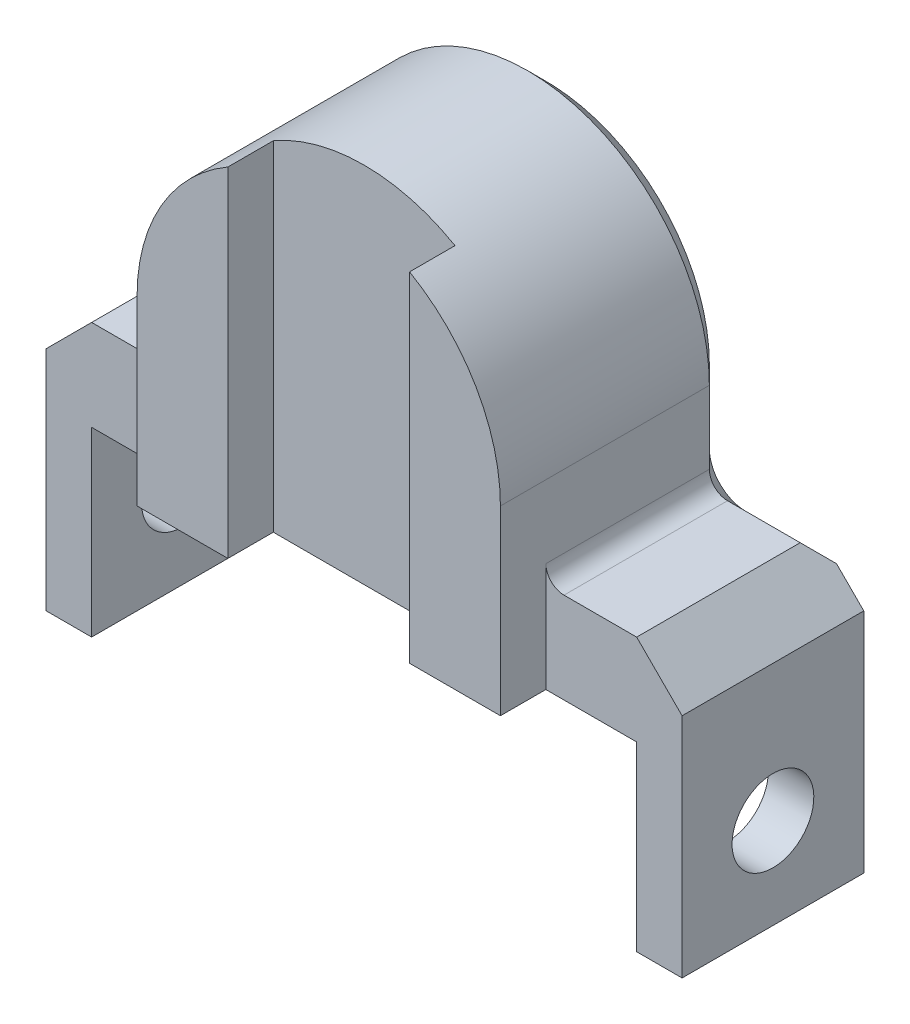
ISO-10303-21;
HEADER;
FILE_DESCRIPTION(('STEP AP214'),'2;1');
FILE_NAME('part.step','',(''),(''),'','','');
FILE_SCHEMA(('AUTOMOTIVE_DESIGN { 1 0 10303 214 1 1 1 1 }'));
ENDSEC;
DATA;
#1=APPLICATION_CONTEXT('core data for automotive mechanical design processes');
#2=APPLICATION_PROTOCOL_DEFINITION('international standard','automotive_design',2000,#1);
#3=PRODUCT_CONTEXT('',#1,'mechanical');
#4=PRODUCT('Part','Part','',(#3));
#5=PRODUCT_RELATED_PRODUCT_CATEGORY('part','',(#4));
#6=PRODUCT_DEFINITION_FORMATION('','',#4);
#7=PRODUCT_DEFINITION_CONTEXT('part definition',#1,'design');
#8=PRODUCT_DEFINITION('design','',#6,#7);
#9=PRODUCT_DEFINITION_SHAPE('','',#8);
#10=(LENGTH_UNIT() NAMED_UNIT(*) SI_UNIT(.MILLI.,.METRE.));
#11=(NAMED_UNIT(*) PLANE_ANGLE_UNIT() SI_UNIT($,.RADIAN.));
#12=(NAMED_UNIT(*) SI_UNIT($,.STERADIAN.) SOLID_ANGLE_UNIT());
#13=UNCERTAINTY_MEASURE_WITH_UNIT(LENGTH_MEASURE(1.E-05),#10,'distance_accuracy_value','');
#14=(GEOMETRIC_REPRESENTATION_CONTEXT(3) GLOBAL_UNCERTAINTY_ASSIGNED_CONTEXT((#13)) GLOBAL_UNIT_ASSIGNED_CONTEXT((#10,
#11,#12)) REPRESENTATION_CONTEXT('',''));
#15=CARTESIAN_POINT('',(0.,0.,0.));
#16=DIRECTION('',(0.,0.,1.));
#17=DIRECTION('',(1.,0.,0.));
#18=AXIS2_PLACEMENT_3D('',#15,#16,#17);
#19=CARTESIAN_POINT('',(0.,20.,10.));
#20=DIRECTION('',(0.,0.,1.));
#21=DIRECTION('',(1.,0.,0.));
#22=AXIS2_PLACEMENT_3D('',#19,#20,#21);
#23=PLANE('',#22);
#24=DIRECTION('',(1.,0.,0.));
#25=VECTOR('',#24,1.);
#26=CARTESIAN_POINT('',(-29.9999999999999,-2.08166817117217E-13,10.));
#27=LINE('',#26,#25);
#28=CARTESIAN_POINT('',(-29.9999999999999,-2.08166817117217E-13,10.));
#29=VERTEX_POINT('',#28);
#30=CARTESIAN_POINT('',(-20.,-1.73472347597681E-13,10.));
#31=VERTEX_POINT('',#30);
#32=EDGE_CURVE('E306',#29,#31,#27,.T.);
#33=ORIENTED_EDGE('',*,*,#32,.T.);
#34=DIRECTION('',(0.,-1.,0.));
#35=VECTOR('',#34,1.);
#36=CARTESIAN_POINT('',(-20.,19.9999999999999,10.));
#37=LINE('',#36,#35);
#38=CARTESIAN_POINT('',(-20.,11.9999999999998,10.));
#39=VERTEX_POINT('',#38);
#40=EDGE_CURVE('E244',#39,#31,#37,.T.);
#41=ORIENTED_EDGE('',*,*,#40,.F.);
#42=CARTESIAN_POINT('',(-21.9999999999999,11.9999999999998,10.));
#43=DIRECTION('',(0.,0.,1.));
#44=DIRECTION('',(1.,0.,0.));
#45=AXIS2_PLACEMENT_3D('',#42,#43,#44);
#46=CIRCLE('',#45,2.);
#47=CARTESIAN_POINT('',(-21.9999999999999,9.99999999999985,10.));
#48=VERTEX_POINT('',#47);
#49=EDGE_CURVE('E378',#39,#48,#46,.F.);
#50=ORIENTED_EDGE('',*,*,#49,.T.);
#51=DIRECTION('',(-1.,0.,0.));
#52=VECTOR('',#51,1.);
#53=CARTESIAN_POINT('',(-19.9999999999999,9.99999999999986,10.));
#54=LINE('',#53,#52);
#55=CARTESIAN_POINT('',(-29.9999999999999,9.99999999999979,10.));
#56=VERTEX_POINT('',#55);
#57=EDGE_CURVE('E296',#48,#56,#54,.T.);
#58=ORIENTED_EDGE('',*,*,#57,.T.);
#59=DIRECTION('',(0.707106781186544,0.707106781186551,0.));
#60=VECTOR('',#59,1.);
#61=CARTESIAN_POINT('',(-10.,29.9999999999999,10.));
#62=LINE('',#61,#60);
#63=CARTESIAN_POINT('',(-34.9999999999999,4.99999999999978,10.));
#64=VERTEX_POINT('',#63);
#65=EDGE_CURVE('E360',#56,#64,#62,.F.);
#66=ORIENTED_EDGE('',*,*,#65,.T.);
#67=DIRECTION('',(0.,-1.,0.));
#68=VECTOR('',#67,1.);
#69=CARTESIAN_POINT('',(-34.9999999999997,-20.0000000000002,10.));
#70=LINE('',#69,#68);
#71=CARTESIAN_POINT('',(-34.9999999999997,-20.0000000000002,10.));
#72=VERTEX_POINT('',#71);
#73=EDGE_CURVE('E299',#64,#72,#70,.T.);
#74=ORIENTED_EDGE('',*,*,#73,.T.);
#75=DIRECTION('',(1.,0.,0.));
#76=VECTOR('',#75,1.);
#77=CARTESIAN_POINT('',(-29.9999999999997,-20.0000000000002,10.));
#78=LINE('',#77,#76);
#79=CARTESIAN_POINT('',(-29.9999999999997,-20.0000000000002,10.));
#80=VERTEX_POINT('',#79);
#81=EDGE_CURVE('E301',#72,#80,#78,.T.);
#82=ORIENTED_EDGE('',*,*,#81,.T.);
#83=DIRECTION('',(0.,1.,0.));
#84=VECTOR('',#83,1.);
#85=CARTESIAN_POINT('',(-29.9999999999999,-2.08166817117217E-13,10.));
#86=LINE('',#85,#84);
#87=EDGE_CURVE('E303',#80,#29,#86,.T.);
#88=ORIENTED_EDGE('',*,*,#87,.T.);
#89=EDGE_LOOP('',(#33,#41,#50,#58,#66,#74,#82,#88));
#90=FACE_BOUND('',#89,.T.);
#91=ADVANCED_FACE('F40',(#90),#23,.T.);
#92=CARTESIAN_POINT('',(0.,20.,10.));
#93=DIRECTION('',(0.,0.,1.));
#94=DIRECTION('',(1.,0.,0.));
#95=AXIS2_PLACEMENT_3D('',#92,#93,#94);
#96=CIRCLE('',#95,20.);
#97=CARTESIAN_POINT('',(10.,37.3205080756888,10.));
#98=VERTEX_POINT('',#97);
#99=CARTESIAN_POINT('',(-10.,37.3205080756888,10.));
#100=VERTEX_POINT('',#99);
#101=EDGE_CURVE('E293',#98,#100,#96,.T.);
#102=ORIENTED_EDGE('',*,*,#101,.T.);
#103=DIRECTION('',(0.,1.,0.));
#104=VECTOR('',#103,1.);
#105=CARTESIAN_POINT('',(-10.,-1.38777878078145E-13,10.));
#106=LINE('',#105,#104);
#107=CARTESIAN_POINT('',(-10.,-1.38777878078145E-13,10.));
#108=VERTEX_POINT('',#107);
#109=EDGE_CURVE('E242',#108,#100,#106,.T.);
#110=ORIENTED_EDGE('',*,*,#109,.F.);
#111=CARTESIAN_POINT('',(10.,-1.38777878078145E-13,10.));
#112=VERTEX_POINT('',#111);
#113=EDGE_CURVE('E310',#108,#112,#27,.T.);
#114=ORIENTED_EDGE('',*,*,#113,.T.);
#115=DIRECTION('',(0.,-1.,0.));
#116=VECTOR('',#115,1.);
#117=CARTESIAN_POINT('',(10.,-1.38777878078145E-13,10.));
#118=LINE('',#117,#116);
#119=EDGE_CURVE('E66',#98,#112,#118,.T.);
#120=ORIENTED_EDGE('',*,*,#119,.F.);
#121=EDGE_LOOP('',(#102,#110,#114,#120));
#122=FACE_BOUND('',#121,.T.);
#123=ADVANCED_FACE('F468',(#122),#23,.T.);
#124=DIRECTION('',(0.,1.,0.));
#125=VECTOR('',#124,1.);
#126=CARTESIAN_POINT('',(20.,19.9999999999999,10.));
#127=LINE('',#126,#125);
#128=CARTESIAN_POINT('',(20.,0.,10.));
#129=VERTEX_POINT('',#128);
#130=CARTESIAN_POINT('',(20.,12.,10.));
#131=VERTEX_POINT('',#130);
#132=EDGE_CURVE('E254',#129,#131,#127,.T.);
#133=ORIENTED_EDGE('',*,*,#132,.F.);
#134=CARTESIAN_POINT('',(30.,0.,10.));
#135=VERTEX_POINT('',#134);
#136=EDGE_CURVE('E305',#129,#135,#27,.T.);
#137=ORIENTED_EDGE('',*,*,#136,.T.);
#138=DIRECTION('',(0.,-1.,0.));
#139=VECTOR('',#138,1.);
#140=CARTESIAN_POINT('',(30.,0.,10.));
#141=LINE('',#140,#139);
#142=CARTESIAN_POINT('',(30.,-20.,10.));
#143=VERTEX_POINT('',#142);
#144=EDGE_CURVE('E309',#135,#143,#141,.T.);
#145=ORIENTED_EDGE('',*,*,#144,.T.);
#146=DIRECTION('',(1.,0.,0.));
#147=VECTOR('',#146,1.);
#148=CARTESIAN_POINT('',(30.,-20.,10.));
#149=LINE('',#148,#147);
#150=CARTESIAN_POINT('',(35.,-20.,10.));
#151=VERTEX_POINT('',#150);
#152=EDGE_CURVE('E312',#143,#151,#149,.T.);
#153=ORIENTED_EDGE('',*,*,#152,.T.);
#154=DIRECTION('',(0.,1.,0.));
#155=VECTOR('',#154,1.);
#156=CARTESIAN_POINT('',(35.,-20.,10.));
#157=LINE('',#156,#155);
#158=CARTESIAN_POINT('',(35.,4.99999999999998,10.));
#159=VERTEX_POINT('',#158);
#160=EDGE_CURVE('E314',#151,#159,#157,.T.);
#161=ORIENTED_EDGE('',*,*,#160,.T.);
#162=DIRECTION('',(0.707106781186546,-0.70710678118655,0.));
#163=VECTOR('',#162,1.);
#164=CARTESIAN_POINT('',(10.0000000000001,30.,10.));
#165=LINE('',#164,#163);
#166=CARTESIAN_POINT('',(30.,10.,10.));
#167=VERTEX_POINT('',#166);
#168=EDGE_CURVE('E358',#159,#167,#165,.F.);
#169=ORIENTED_EDGE('',*,*,#168,.T.);
#170=DIRECTION('',(-1.,0.,0.));
#171=VECTOR('',#170,1.);
#172=CARTESIAN_POINT('',(20.,10.,10.));
#173=LINE('',#172,#171);
#174=CARTESIAN_POINT('',(22.,10.,10.));
#175=VERTEX_POINT('',#174);
#176=EDGE_CURVE('E290',#167,#175,#173,.T.);
#177=ORIENTED_EDGE('',*,*,#176,.T.);
#178=CARTESIAN_POINT('',(22.,12.,10.));
#179=DIRECTION('',(0.,0.,1.));
#180=DIRECTION('',(1.,0.,0.));
#181=AXIS2_PLACEMENT_3D('',#178,#179,#180);
#182=CIRCLE('',#181,2.);
#183=EDGE_CURVE('E380',#175,#131,#182,.F.);
#184=ORIENTED_EDGE('',*,*,#183,.T.);
#185=EDGE_LOOP('',(#133,#137,#145,#153,#161,#169,#177,#184));
#186=FACE_BOUND('',#185,.T.);
#187=ADVANCED_FACE('F514',(#186),#23,.T.);
#188=CARTESIAN_POINT('',(20.,10.,10.));
#189=DIRECTION('',(0.,-1.,0.));
#190=DIRECTION('',(1.,0.,0.));
#191=AXIS2_PLACEMENT_3D('',#188,#189,#190);
#192=PLANE('',#191);
#193=DIRECTION('',(0.,0.,-1.));
#194=VECTOR('',#193,1.);
#195=CARTESIAN_POINT('',(30.,10.,10.));
#196=LINE('',#195,#194);
#197=CARTESIAN_POINT('',(30.,10.,-8.00000000000001));
#198=VERTEX_POINT('',#197);
#199=EDGE_CURVE('E362',#167,#198,#196,.T.);
#200=ORIENTED_EDGE('',*,*,#199,.T.);
#201=DIRECTION('',(-1.,0.,0.));
#202=VECTOR('',#201,1.);
#203=CARTESIAN_POINT('',(20.,10.,-8.00000000000001));
#204=LINE('',#203,#202);
#205=CARTESIAN_POINT('',(22.,10.,-8.00000000000001));
#206=VERTEX_POINT('',#205);
#207=EDGE_CURVE('E382',#198,#206,#204,.T.);
#208=ORIENTED_EDGE('',*,*,#207,.T.);
#209=DIRECTION('',(0.,0.,-1.));
#210=VECTOR('',#209,1.);
#211=CARTESIAN_POINT('',(22.,10.,10.));
#212=LINE('',#211,#210);
#213=EDGE_CURVE('E376',#206,#175,#212,.F.);
#214=ORIENTED_EDGE('',*,*,#213,.T.);
#215=ORIENTED_EDGE('',*,*,#176,.F.);
#216=EDGE_LOOP('',(#200,#208,#214,#215));
#217=FACE_BOUND('',#216,.T.);
#218=ADVANCED_FACE('F521',(#217),#192,.F.);
#219=CARTESIAN_POINT('',(20.,20.,10.));
#220=DIRECTION('',(-1.,0.,0.));
#221=DIRECTION('',(0.,0.,1.));
#222=AXIS2_PLACEMENT_3D('',#219,#220,#221);
#223=PLANE('',#222);
#224=DIRECTION('',(0.,0.,-1.));
#225=VECTOR('',#224,1.);
#226=CARTESIAN_POINT('',(20.,12.,-10.));
#227=LINE('',#226,#225);
#228=CARTESIAN_POINT('',(20.,12.,-8.00000000000001));
#229=VERTEX_POINT('',#228);
#230=EDGE_CURVE('E373',#131,#229,#227,.T.);
#231=ORIENTED_EDGE('',*,*,#230,.T.);
#232=DIRECTION('',(0.,1.,0.));
#233=VECTOR('',#232,1.);
#234=CARTESIAN_POINT('',(20.,20.,-8.00000000000001));
#235=LINE('',#234,#233);
#236=CARTESIAN_POINT('',(20.,20.,-8.00000000000001));
#237=VERTEX_POINT('',#236);
#238=EDGE_CURVE('E409',#229,#237,#235,.T.);
#239=ORIENTED_EDGE('',*,*,#238,.T.);
#240=DIRECTION('',(0.,0.,-1.));
#241=VECTOR('',#240,1.);
#242=CARTESIAN_POINT('',(20.,20.,10.));
#243=LINE('',#242,#241);
#244=CARTESIAN_POINT('',(20.,19.9999999999999,15.));
#245=VERTEX_POINT('',#244);
#246=EDGE_CURVE('E227',#245,#237,#243,.T.);
#247=ORIENTED_EDGE('',*,*,#246,.F.);
#248=DIRECTION('',(0.,1.,0.));
#249=VECTOR('',#248,1.);
#250=CARTESIAN_POINT('',(20.,19.9999999999999,15.));
#251=LINE('',#250,#249);
#252=CARTESIAN_POINT('',(20.,-1.73472347597681E-13,15.));
#253=VERTEX_POINT('',#252);
#254=EDGE_CURVE('E255',#253,#245,#251,.T.);
#255=ORIENTED_EDGE('',*,*,#254,.F.);
#256=DIRECTION('',(0.,0.,-1.));
#257=VECTOR('',#256,1.);
#258=CARTESIAN_POINT('',(20.,-1.73472347597681E-13,15.));
#259=LINE('',#258,#257);
#260=EDGE_CURVE('E264',#253,#129,#259,.T.);
#261=ORIENTED_EDGE('',*,*,#260,.T.);
#262=ORIENTED_EDGE('',*,*,#132,.T.);
#263=EDGE_LOOP('',(#231,#239,#247,#255,#261,#262));
#264=FACE_BOUND('',#263,.T.);
#265=ADVANCED_FACE('F526',(#264),#223,.F.);
#266=CARTESIAN_POINT('',(0.,20.,10.));
#267=DIRECTION('',(0.,0.,-1.));
#268=DIRECTION('',(-1.,0.,0.));
#269=AXIS2_PLACEMENT_3D('',#266,#267,#268);
#270=CYLINDRICAL_SURFACE('',#269,20.);
#271=ORIENTED_EDGE('',*,*,#246,.T.);
#272=CARTESIAN_POINT('',(0.,20.,-8.00000000000001));
#273=DIRECTION('',(0.,0.,1.));
#274=DIRECTION('',(1.,0.,0.));
#275=AXIS2_PLACEMENT_3D('',#272,#273,#274);
#276=CIRCLE('',#275,20.);
#277=CARTESIAN_POINT('',(-20.,19.9999999999999,-8.00000000000001));
#278=VERTEX_POINT('',#277);
#279=EDGE_CURVE('E11',#237,#278,#276,.T.);
#280=ORIENTED_EDGE('',*,*,#279,.T.);
#281=DIRECTION('',(0.,0.,-1.));
#282=VECTOR('',#281,1.);
#283=CARTESIAN_POINT('',(-20.,19.9999999999999,10.));
#284=LINE('',#283,#282);
#285=CARTESIAN_POINT('',(-20.,19.9999999999999,15.));
#286=VERTEX_POINT('',#285);
#287=EDGE_CURVE('E217',#286,#278,#284,.T.);
#288=ORIENTED_EDGE('',*,*,#287,.F.);
#289=CARTESIAN_POINT('',(0.,20.,15.));
#290=DIRECTION('',(0.,0.,1.));
#291=DIRECTION('',(1.,0.,0.));
#292=AXIS2_PLACEMENT_3D('',#289,#290,#291);
#293=CIRCLE('',#292,20.);
#294=CARTESIAN_POINT('',(-10.,37.3205080756888,15.));
#295=VERTEX_POINT('',#294);
#296=EDGE_CURVE('E223',#295,#286,#293,.T.);
#297=ORIENTED_EDGE('',*,*,#296,.F.);
#298=DIRECTION('',(0.,0.,-1.));
#299=VECTOR('',#298,1.);
#300=CARTESIAN_POINT('',(-10.,37.3205080756888,15.));
#301=LINE('',#300,#299);
#302=EDGE_CURVE('E249',#295,#100,#301,.T.);
#303=ORIENTED_EDGE('',*,*,#302,.T.);
#304=ORIENTED_EDGE('',*,*,#101,.F.);
#305=DIRECTION('',(0.,0.,-1.));
#306=VECTOR('',#305,1.);
#307=CARTESIAN_POINT('',(10.,37.3205080756888,15.));
#308=LINE('',#307,#306);
#309=CARTESIAN_POINT('',(10.,37.3205080756888,15.));
#310=VERTEX_POINT('',#309);
#311=EDGE_CURVE('E273',#310,#98,#308,.T.);
#312=ORIENTED_EDGE('',*,*,#311,.F.);
#313=CARTESIAN_POINT('',(0.,20.,15.));
#314=DIRECTION('',(0.,0.,1.));
#315=DIRECTION('',(-1.,0.,0.));
#316=AXIS2_PLACEMENT_3D('',#313,#314,#315);
#317=CIRCLE('',#316,20.);
#318=EDGE_CURVE('E258',#245,#310,#317,.T.);
#319=ORIENTED_EDGE('',*,*,#318,.F.);
#320=EDGE_LOOP('',(#271,#280,#288,#297,#303,#304,#312,#319));
#321=FACE_BOUND('',#320,.T.);
#322=ADVANCED_FACE('F220',(#321),#270,.T.);
#323=CARTESIAN_POINT('',(-20.,19.9999999999999,10.));
#324=DIRECTION('',(1.,0.,0.));
#325=DIRECTION('',(0.,1.,0.));
#326=AXIS2_PLACEMENT_3D('',#323,#324,#325);
#327=PLANE('',#326);
#328=ORIENTED_EDGE('',*,*,#287,.T.);
#329=DIRECTION('',(0.,-1.,0.));
#330=VECTOR('',#329,1.);
#331=CARTESIAN_POINT('',(-20.,19.9999999999999,-8.00000000000001));
#332=LINE('',#331,#330);
#333=CARTESIAN_POINT('',(-19.9999999999999,11.9999999999999,-8.00000000000001));
#334=VERTEX_POINT('',#333);
#335=EDGE_CURVE('E50',#278,#334,#332,.T.);
#336=ORIENTED_EDGE('',*,*,#335,.T.);
#337=DIRECTION('',(0.,0.,-1.));
#338=VECTOR('',#337,1.);
#339=CARTESIAN_POINT('',(-19.9999999999999,11.9999999999999,10.));
#340=LINE('',#339,#338);
#341=EDGE_CURVE('E370',#334,#39,#340,.F.);
#342=ORIENTED_EDGE('',*,*,#341,.T.);
#343=ORIENTED_EDGE('',*,*,#40,.T.);
#344=DIRECTION('',(0.,0.,-1.));
#345=VECTOR('',#344,1.);
#346=CARTESIAN_POINT('',(-20.,-1.73472347597681E-13,15.));
#347=LINE('',#346,#345);
#348=CARTESIAN_POINT('',(-20.,-1.73472347597681E-13,15.));
#349=VERTEX_POINT('',#348);
#350=EDGE_CURVE('E234',#349,#31,#347,.T.);
#351=ORIENTED_EDGE('',*,*,#350,.F.);
#352=DIRECTION('',(0.,-1.,0.));
#353=VECTOR('',#352,1.);
#354=CARTESIAN_POINT('',(-20.,19.9999999999999,15.));
#355=LINE('',#354,#353);
#356=EDGE_CURVE('E231',#286,#349,#355,.T.);
#357=ORIENTED_EDGE('',*,*,#356,.F.);
#358=EDGE_LOOP('',(#328,#336,#342,#343,#351,#357));
#359=FACE_BOUND('',#358,.T.);
#360=ADVANCED_FACE('F232',(#359),#327,.F.);
#361=CARTESIAN_POINT('',(-19.9999999999999,9.99999999999986,10.));
#362=DIRECTION('',(0.,-1.,0.));
#363=DIRECTION('',(1.,0.,0.));
#364=AXIS2_PLACEMENT_3D('',#361,#362,#363);
#365=PLANE('',#364);
#366=DIRECTION('',(0.,0.,-1.));
#367=VECTOR('',#366,1.);
#368=CARTESIAN_POINT('',(-21.9999999999999,9.99999999999985,-10.));
#369=LINE('',#368,#367);
#370=CARTESIAN_POINT('',(-21.9999999999999,9.99999999999985,-8.00000000000001));
#371=VERTEX_POINT('',#370);
#372=EDGE_CURVE('E367',#48,#371,#369,.T.);
#373=ORIENTED_EDGE('',*,*,#372,.T.);
#374=DIRECTION('',(-1.,0.,0.));
#375=VECTOR('',#374,1.);
#376=CARTESIAN_POINT('',(-19.9999999999999,9.99999999999986,-8.00000000000001));
#377=LINE('',#376,#375);
#378=CARTESIAN_POINT('',(-29.9999999999999,9.99999999999979,-8.00000000000001));
#379=VERTEX_POINT('',#378);
#380=EDGE_CURVE('E401',#371,#379,#377,.T.);
#381=ORIENTED_EDGE('',*,*,#380,.T.);
#382=DIRECTION('',(0.,0.,1.));
#383=VECTOR('',#382,1.);
#384=CARTESIAN_POINT('',(-29.9999999999999,9.99999999999979,10.));
#385=LINE('',#384,#383);
#386=EDGE_CURVE('E356',#379,#56,#385,.T.);
#387=ORIENTED_EDGE('',*,*,#386,.T.);
#388=ORIENTED_EDGE('',*,*,#57,.F.);
#389=EDGE_LOOP('',(#373,#381,#387,#388));
#390=FACE_BOUND('',#389,.T.);
#391=ADVANCED_FACE('F438',(#390),#365,.F.);
#392=CARTESIAN_POINT('',(-34.9999999999997,-20.0000000000002,10.));
#393=DIRECTION('',(1.,0.,0.));
#394=DIRECTION('',(0.,1.,0.));
#395=AXIS2_PLACEMENT_3D('',#392,#393,#394);
#396=PLANE('',#395);
#397=CARTESIAN_POINT('',(-34.9999999999998,-10.0000000000003,0.));
#398=DIRECTION('',(-1.,0.,0.));
#399=DIRECTION('',(0.,-1.,0.));
#400=AXIS2_PLACEMENT_3D('',#397,#398,#399);
#401=CIRCLE('',#400,4.5);
#402=CARTESIAN_POINT('',(-34.9999999999998,-14.5000000000002,0.));
#403=VERTEX_POINT('',#402);
#404=EDGE_CURVE('E281',#403,#403,#401,.T.);
#405=ORIENTED_EDGE('',*,*,#404,.F.);
#406=EDGE_LOOP('',(#405));
#407=FACE_BOUND('',#406,.T.);
#408=ORIENTED_EDGE('',*,*,#73,.F.);
#409=DIRECTION('',(0.,0.,-1.));
#410=VECTOR('',#409,1.);
#411=CARTESIAN_POINT('',(-34.9999999999999,4.99999999999978,10.));
#412=LINE('',#411,#410);
#413=CARTESIAN_POINT('',(-34.9999999999999,4.99999999999978,-10.));
#414=VERTEX_POINT('',#413);
#415=EDGE_CURVE('E348',#64,#414,#412,.T.);
#416=ORIENTED_EDGE('',*,*,#415,.T.);
#417=DIRECTION('',(0.,-1.,0.));
#418=VECTOR('',#417,1.);
#419=CARTESIAN_POINT('',(-34.9999999999997,-20.0000000000002,-10.));
#420=LINE('',#419,#418);
#421=CARTESIAN_POINT('',(-34.9999999999997,-20.0000000000002,-10.));
#422=VERTEX_POINT('',#421);
#423=EDGE_CURVE('E289',#414,#422,#420,.T.);
#424=ORIENTED_EDGE('',*,*,#423,.T.);
#425=DIRECTION('',(0.,0.,-1.));
#426=VECTOR('',#425,1.);
#427=CARTESIAN_POINT('',(-34.9999999999997,-20.0000000000002,10.));
#428=LINE('',#427,#426);
#429=EDGE_CURVE('E228',#72,#422,#428,.T.);
#430=ORIENTED_EDGE('',*,*,#429,.F.);
#431=EDGE_LOOP('',(#408,#416,#424,#430));
#432=FACE_BOUND('',#431,.T.);
#433=ADVANCED_FACE('F449',(#407,#432),#396,.F.);
#434=CARTESIAN_POINT('',(-29.9999999999997,-20.0000000000002,10.));
#435=DIRECTION('',(0.,1.,0.));
#436=DIRECTION('',(-1.,0.,0.));
#437=AXIS2_PLACEMENT_3D('',#434,#435,#436);
#438=PLANE('',#437);
#439=DIRECTION('',(1.,0.,0.));
#440=VECTOR('',#439,1.);
#441=CARTESIAN_POINT('',(-29.9999999999997,-20.0000000000002,-10.));
#442=LINE('',#441,#440);
#443=CARTESIAN_POINT('',(-29.9999999999997,-20.0000000000002,-10.));
#444=VERTEX_POINT('',#443);
#445=EDGE_CURVE('E319',#422,#444,#442,.T.);
#446=ORIENTED_EDGE('',*,*,#445,.T.);
#447=DIRECTION('',(0.,0.,-1.));
#448=VECTOR('',#447,1.);
#449=CARTESIAN_POINT('',(-29.9999999999997,-20.0000000000002,10.));
#450=LINE('',#449,#448);
#451=EDGE_CURVE('E342',#80,#444,#450,.T.);
#452=ORIENTED_EDGE('',*,*,#451,.F.);
#453=ORIENTED_EDGE('',*,*,#81,.F.);
#454=ORIENTED_EDGE('',*,*,#429,.T.);
#455=EDGE_LOOP('',(#446,#452,#453,#454));
#456=FACE_BOUND('',#455,.T.);
#457=ADVANCED_FACE('F455',(#456),#438,.F.);
#458=CARTESIAN_POINT('',(-29.9999999999999,-2.08166817117217E-13,10.));
#459=DIRECTION('',(-1.,0.,0.));
#460=DIRECTION('',(0.,-1.,0.));
#461=AXIS2_PLACEMENT_3D('',#458,#459,#460);
#462=PLANE('',#461);
#463=CARTESIAN_POINT('',(-29.9999999999998,-10.0000000000002,0.));
#464=DIRECTION('',(-1.,0.,0.));
#465=DIRECTION('',(0.,-1.,0.));
#466=AXIS2_PLACEMENT_3D('',#463,#464,#465);
#467=CIRCLE('',#466,4.5);
#468=CARTESIAN_POINT('',(-29.9999999999998,-14.5000000000002,0.));
#469=VERTEX_POINT('',#468);
#470=EDGE_CURVE('E286',#469,#469,#467,.T.);
#471=ORIENTED_EDGE('',*,*,#470,.T.);
#472=EDGE_LOOP('',(#471));
#473=FACE_BOUND('',#472,.T.);
#474=DIRECTION('',(0.,1.,0.));
#475=VECTOR('',#474,1.);
#476=CARTESIAN_POINT('',(-29.9999999999999,-2.08166817117217E-13,-10.));
#477=LINE('',#476,#475);
#478=CARTESIAN_POINT('',(-29.9999999999999,-2.08166817117217E-13,-10.));
#479=VERTEX_POINT('',#478);
#480=EDGE_CURVE('E321',#444,#479,#477,.T.);
#481=ORIENTED_EDGE('',*,*,#480,.T.);
#482=DIRECTION('',(0.,0.,-1.));
#483=VECTOR('',#482,1.);
#484=CARTESIAN_POINT('',(-29.9999999999999,-2.08166817117217E-13,10.));
#485=LINE('',#484,#483);
#486=EDGE_CURVE('E339',#29,#479,#485,.T.);
#487=ORIENTED_EDGE('',*,*,#486,.F.);
#488=ORIENTED_EDGE('',*,*,#87,.F.);
#489=ORIENTED_EDGE('',*,*,#451,.T.);
#490=EDGE_LOOP('',(#481,#487,#488,#489));
#491=FACE_BOUND('',#490,.T.);
#492=ADVANCED_FACE('F460',(#473,#491),#462,.F.);
#493=CARTESIAN_POINT('',(-29.9999999999999,-2.08166817117217E-13,10.));
#494=DIRECTION('',(0.,1.,0.));
#495=DIRECTION('',(-1.,0.,0.));
#496=AXIS2_PLACEMENT_3D('',#493,#494,#495);
#497=PLANE('',#496);
#498=DIRECTION('',(1.,0.,0.));
#499=VECTOR('',#498,1.);
#500=CARTESIAN_POINT('',(-29.9999999999999,-2.08166817117217E-13,-10.));
#501=LINE('',#500,#499);
#502=CARTESIAN_POINT('',(30.,0.,-10.));
#503=VERTEX_POINT('',#502);
#504=EDGE_CURVE('E323',#479,#503,#501,.T.);
#505=ORIENTED_EDGE('',*,*,#504,.T.);
#506=DIRECTION('',(0.,0.,-1.));
#507=VECTOR('',#506,1.);
#508=CARTESIAN_POINT('',(30.,0.,10.));
#509=LINE('',#508,#507);
#510=EDGE_CURVE('E336',#135,#503,#509,.T.);
#511=ORIENTED_EDGE('',*,*,#510,.F.);
#512=ORIENTED_EDGE('',*,*,#136,.F.);
#513=ORIENTED_EDGE('',*,*,#260,.F.);
#514=DIRECTION('',(1.,0.,0.));
#515=VECTOR('',#514,1.);
#516=CARTESIAN_POINT('',(20.,-1.73472347597681E-13,15.));
#517=LINE('',#516,#515);
#518=CARTESIAN_POINT('',(10.,-1.38777878078145E-13,15.));
#519=VERTEX_POINT('',#518);
#520=EDGE_CURVE('E262',#519,#253,#517,.T.);
#521=ORIENTED_EDGE('',*,*,#520,.F.);
#522=DIRECTION('',(0.,0.,-1.));
#523=VECTOR('',#522,1.);
#524=CARTESIAN_POINT('',(10.,-1.38777878078145E-13,15.));
#525=LINE('',#524,#523);
#526=EDGE_CURVE('E270',#519,#112,#525,.T.);
#527=ORIENTED_EDGE('',*,*,#526,.T.);
#528=ORIENTED_EDGE('',*,*,#113,.F.);
#529=DIRECTION('',(0.,0.,-1.));
#530=VECTOR('',#529,1.);
#531=CARTESIAN_POINT('',(-10.,-1.38777878078145E-13,15.));
#532=LINE('',#531,#530);
#533=CARTESIAN_POINT('',(-10.,-1.38777878078145E-13,15.));
#534=VERTEX_POINT('',#533);
#535=EDGE_CURVE('E58',#534,#108,#532,.T.);
#536=ORIENTED_EDGE('',*,*,#535,.F.);
#537=DIRECTION('',(1.,0.,0.));
#538=VECTOR('',#537,1.);
#539=CARTESIAN_POINT('',(-20.,-1.73472347597681E-13,15.));
#540=LINE('',#539,#538);
#541=EDGE_CURVE('E237',#349,#534,#540,.T.);
#542=ORIENTED_EDGE('',*,*,#541,.F.);
#543=ORIENTED_EDGE('',*,*,#350,.T.);
#544=ORIENTED_EDGE('',*,*,#32,.F.);
#545=ORIENTED_EDGE('',*,*,#486,.T.);
#546=EDGE_LOOP('',(#505,#511,#512,#513,#521,#527,#528,#536,#542,#543,#544,#545));
#547=FACE_BOUND('',#546,.T.);
#548=ADVANCED_FACE('F464',(#547),#497,.F.);
#549=CARTESIAN_POINT('',(30.,0.,10.));
#550=DIRECTION('',(1.,0.,0.));
#551=DIRECTION('',(0.,0.,-1.));
#552=AXIS2_PLACEMENT_3D('',#549,#550,#551);
#553=PLANE('',#552);
#554=CARTESIAN_POINT('',(30.,-9.9999999999998,0.));
#555=DIRECTION('',(1.,0.,0.));
#556=DIRECTION('',(0.,0.,-1.));
#557=AXIS2_PLACEMENT_3D('',#554,#555,#556);
#558=CIRCLE('',#557,4.5);
#559=CARTESIAN_POINT('',(30.,-9.9999999999998,-4.5));
#560=VERTEX_POINT('',#559);
#561=EDGE_CURVE('E280',#560,#560,#558,.T.);
#562=ORIENTED_EDGE('',*,*,#561,.T.);
#563=EDGE_LOOP('',(#562));
#564=FACE_BOUND('',#563,.T.);
#565=DIRECTION('',(0.,-1.,0.));
#566=VECTOR('',#565,1.);
#567=CARTESIAN_POINT('',(30.,0.,-10.));
#568=LINE('',#567,#566);
#569=CARTESIAN_POINT('',(30.,-20.,-10.));
#570=VERTEX_POINT('',#569);
#571=EDGE_CURVE('E325',#503,#570,#568,.T.);
#572=ORIENTED_EDGE('',*,*,#571,.T.);
#573=DIRECTION('',(0.,0.,-1.));
#574=VECTOR('',#573,1.);
#575=CARTESIAN_POINT('',(30.,-20.,10.));
#576=LINE('',#575,#574);
#577=EDGE_CURVE('E333',#143,#570,#576,.T.);
#578=ORIENTED_EDGE('',*,*,#577,.F.);
#579=ORIENTED_EDGE('',*,*,#144,.F.);
#580=ORIENTED_EDGE('',*,*,#510,.T.);
#581=EDGE_LOOP('',(#572,#578,#579,#580));
#582=FACE_BOUND('',#581,.T.);
#583=ADVANCED_FACE('F606',(#564,#582),#553,.F.);
#584=CARTESIAN_POINT('',(30.,-20.,10.));
#585=DIRECTION('',(0.,1.,0.));
#586=DIRECTION('',(0.,0.,1.));
#587=AXIS2_PLACEMENT_3D('',#584,#585,#586);
#588=PLANE('',#587);
#589=DIRECTION('',(1.,0.,0.));
#590=VECTOR('',#589,1.);
#591=CARTESIAN_POINT('',(30.,-20.,-10.));
#592=LINE('',#591,#590);
#593=CARTESIAN_POINT('',(35.,-20.,-10.));
#594=VERTEX_POINT('',#593);
#595=EDGE_CURVE('E327',#570,#594,#592,.T.);
#596=ORIENTED_EDGE('',*,*,#595,.T.);
#597=DIRECTION('',(0.,0.,-1.));
#598=VECTOR('',#597,1.);
#599=CARTESIAN_POINT('',(35.,-20.,10.));
#600=LINE('',#599,#598);
#601=EDGE_CURVE('E317',#151,#594,#600,.T.);
#602=ORIENTED_EDGE('',*,*,#601,.F.);
#603=ORIENTED_EDGE('',*,*,#152,.F.);
#604=ORIENTED_EDGE('',*,*,#577,.T.);
#605=EDGE_LOOP('',(#596,#602,#603,#604));
#606=FACE_BOUND('',#605,.T.);
#607=ADVANCED_FACE('F602',(#606),#588,.F.);
#608=CARTESIAN_POINT('',(35.,-20.,10.));
#609=DIRECTION('',(-1.,0.,0.));
#610=DIRECTION('',(0.,0.,1.));
#611=AXIS2_PLACEMENT_3D('',#608,#609,#610);
#612=PLANE('',#611);
#613=CARTESIAN_POINT('',(35.0000000000003,-9.99999999999976,0.));
#614=DIRECTION('',(-1.,0.,0.));
#615=DIRECTION('',(0.,-1.,0.));
#616=AXIS2_PLACEMENT_3D('',#613,#614,#615);
#617=CIRCLE('',#616,4.5);
#618=CARTESIAN_POINT('',(35.0000000000004,-14.4999999999998,0.));
#619=VERTEX_POINT('',#618);
#620=EDGE_CURVE('E277',#619,#619,#617,.T.);
#621=ORIENTED_EDGE('',*,*,#620,.T.);
#622=EDGE_LOOP('',(#621));
#623=FACE_BOUND('',#622,.T.);
#624=DIRECTION('',(0.,1.,0.));
#625=VECTOR('',#624,1.);
#626=CARTESIAN_POINT('',(35.,-20.,-10.));
#627=LINE('',#626,#625);
#628=CARTESIAN_POINT('',(35.,4.99999999999998,-10.));
#629=VERTEX_POINT('',#628);
#630=EDGE_CURVE('E294',#594,#629,#627,.T.);
#631=ORIENTED_EDGE('',*,*,#630,.T.);
#632=DIRECTION('',(0.,0.,1.));
#633=VECTOR('',#632,1.);
#634=CARTESIAN_POINT('',(35.,4.99999999999998,10.));
#635=LINE('',#634,#633);
#636=EDGE_CURVE('E365',#629,#159,#635,.T.);
#637=ORIENTED_EDGE('',*,*,#636,.T.);
#638=ORIENTED_EDGE('',*,*,#160,.F.);
#639=ORIENTED_EDGE('',*,*,#601,.T.);
#640=EDGE_LOOP('',(#631,#637,#638,#639));
#641=FACE_BOUND('',#640,.T.);
#642=ADVANCED_FACE('F596',(#623,#641),#612,.F.);
#643=CARTESIAN_POINT('',(0.,20.,-10.));
#644=DIRECTION('',(0.,0.,1.));
#645=DIRECTION('',(1.,0.,0.));
#646=AXIS2_PLACEMENT_3D('',#643,#644,#645);
#647=PLANE('',#646);
#648=CARTESIAN_POINT('',(22.,12.,-10.));
#649=DIRECTION('',(0.,0.,1.));
#650=DIRECTION('',(1.,0.,0.));
#651=AXIS2_PLACEMENT_3D('',#648,#649,#650);
#652=CIRCLE('',#651,4.00000000000001);
#653=CARTESIAN_POINT('',(18.,12.,-10.));
#654=VERTEX_POINT('',#653);
#655=CARTESIAN_POINT('',(22.,7.99999999999999,-10.));
#656=VERTEX_POINT('',#655);
#657=EDGE_CURVE('E393',#654,#656,#652,.T.);
#658=ORIENTED_EDGE('',*,*,#657,.T.);
#659=DIRECTION('',(1.,0.,0.));
#660=VECTOR('',#659,1.);
#661=CARTESIAN_POINT('',(0.,7.99999999999999,-10.));
#662=LINE('',#661,#660);
#663=CARTESIAN_POINT('',(32.,7.99999999999999,-10.));
#664=VERTEX_POINT('',#663);
#665=EDGE_CURVE('E397',#656,#664,#662,.T.);
#666=ORIENTED_EDGE('',*,*,#665,.T.);
#667=DIRECTION('',(-0.707106781186546,0.70710678118655,0.));
#668=VECTOR('',#667,1.);
#669=CARTESIAN_POINT('',(30.,10.,-10.));
#670=LINE('',#669,#668);
#671=EDGE_CURVE('E351',#664,#629,#670,.F.);
#672=ORIENTED_EDGE('',*,*,#671,.T.);
#673=ORIENTED_EDGE('',*,*,#630,.F.);
#674=ORIENTED_EDGE('',*,*,#595,.F.);
#675=ORIENTED_EDGE('',*,*,#571,.F.);
#676=ORIENTED_EDGE('',*,*,#504,.F.);
#677=ORIENTED_EDGE('',*,*,#480,.F.);
#678=ORIENTED_EDGE('',*,*,#445,.F.);
#679=ORIENTED_EDGE('',*,*,#423,.F.);
#680=DIRECTION('',(-0.707106781186544,-0.707106781186551,0.));
#681=VECTOR('',#680,1.);
#682=CARTESIAN_POINT('',(-34.9999999999999,4.99999999999978,-10.));
#683=LINE('',#682,#681);
#684=CARTESIAN_POINT('',(-31.9999999999999,7.99999999999977,-10.));
#685=VERTEX_POINT('',#684);
#686=EDGE_CURVE('E353',#414,#685,#683,.F.);
#687=ORIENTED_EDGE('',*,*,#686,.T.);
#688=DIRECTION('',(1.,0.,0.));
#689=VECTOR('',#688,1.);
#690=CARTESIAN_POINT('',(0.,7.99999999999999,-10.));
#691=LINE('',#690,#689);
#692=CARTESIAN_POINT('',(-21.9999999999999,7.99999999999984,-10.));
#693=VERTEX_POINT('',#692);
#694=EDGE_CURVE('E395',#685,#693,#691,.T.);
#695=ORIENTED_EDGE('',*,*,#694,.T.);
#696=CARTESIAN_POINT('',(-21.9999999999999,11.9999999999998,-10.));
#697=DIRECTION('',(0.,0.,1.));
#698=DIRECTION('',(1.,0.,0.));
#699=AXIS2_PLACEMENT_3D('',#696,#697,#698);
#700=CIRCLE('',#699,4.00000000000001);
#701=CARTESIAN_POINT('',(-17.9999999999999,11.9999999999999,-10.));
#702=VERTEX_POINT('',#701);
#703=EDGE_CURVE('E391',#693,#702,#700,.T.);
#704=ORIENTED_EDGE('',*,*,#703,.T.);
#705=DIRECTION('',(0.,1.,0.));
#706=VECTOR('',#705,1.);
#707=CARTESIAN_POINT('',(-18.,19.9999999999999,-10.));
#708=LINE('',#707,#706);
#709=CARTESIAN_POINT('',(-18.,19.9999999999999,-10.));
#710=VERTEX_POINT('',#709);
#711=EDGE_CURVE('E387',#702,#710,#708,.T.);
#712=ORIENTED_EDGE('',*,*,#711,.T.);
#713=CARTESIAN_POINT('',(0.,20.,-10.));
#714=DIRECTION('',(0.,0.,1.));
#715=DIRECTION('',(1.,0.,0.));
#716=AXIS2_PLACEMENT_3D('',#713,#714,#715);
#717=CIRCLE('',#716,18.);
#718=CARTESIAN_POINT('',(18.,20.,-10.));
#719=VERTEX_POINT('',#718);
#720=EDGE_CURVE('E385',#710,#719,#717,.F.);
#721=ORIENTED_EDGE('',*,*,#720,.T.);
#722=DIRECTION('',(0.,-1.,0.));
#723=VECTOR('',#722,1.);
#724=CARTESIAN_POINT('',(18.,20.,-10.));
#725=LINE('',#724,#723);
#726=EDGE_CURVE('E389',#719,#654,#725,.T.);
#727=ORIENTED_EDGE('',*,*,#726,.T.);
#728=EDGE_LOOP('',(#658,#666,#672,#673,#674,#675,#676,#677,#678,#679,#687,#695,#704,#712,#721,#727));
#729=FACE_BOUND('',#728,.T.);
#730=ADVANCED_FACE('F493',(#729),#647,.F.);
#731=CARTESIAN_POINT('',(35.0000000000003,-9.99999999999976,0.));
#732=DIRECTION('',(-1.,0.,0.));
#733=DIRECTION('',(0.,-1.,0.));
#734=AXIS2_PLACEMENT_3D('',#731,#732,#733);
#735=CYLINDRICAL_SURFACE('',#734,4.5);
#736=ORIENTED_EDGE('',*,*,#620,.F.);
#737=EDGE_LOOP('',(#736));
#738=FACE_BOUND('',#737,.T.);
#739=ORIENTED_EDGE('',*,*,#561,.F.);
#740=EDGE_LOOP('',(#739));
#741=FACE_BOUND('',#740,.T.);
#742=ADVANCED_FACE('F706',(#738,#741),#735,.F.);
#743=ORIENTED_EDGE('',*,*,#404,.T.);
#744=EDGE_LOOP('',(#743));
#745=FACE_BOUND('',#744,.T.);
#746=ORIENTED_EDGE('',*,*,#470,.F.);
#747=EDGE_LOOP('',(#746));
#748=FACE_BOUND('',#747,.T.);
#749=ADVANCED_FACE('F546',(#745,#748),#735,.F.);
#750=CARTESIAN_POINT('',(-34.9999999999999,4.99999999999978,10.));
#751=DIRECTION('',(0.707106781186551,-0.707106781186544,0.));
#752=DIRECTION('',(0.,0.,-1.));
#753=AXIS2_PLACEMENT_3D('',#750,#751,#752);
#754=PLANE('',#753);
#755=ORIENTED_EDGE('',*,*,#386,.F.);
#756=DIRECTION('',(-0.577350269189625,-0.577350269189631,-0.577350269189622));
#757=VECTOR('',#756,1.);
#758=CARTESIAN_POINT('',(-27.3333333333333,12.6666666666664,-5.33333333333341));
#759=LINE('',#758,#757);
#760=EDGE_CURVE('E403',#379,#685,#759,.T.);
#761=ORIENTED_EDGE('',*,*,#760,.T.);
#762=ORIENTED_EDGE('',*,*,#686,.F.);
#763=ORIENTED_EDGE('',*,*,#415,.F.);
#764=ORIENTED_EDGE('',*,*,#65,.F.);
#765=EDGE_LOOP('',(#755,#761,#762,#763,#764));
#766=FACE_BOUND('',#765,.T.);
#767=ADVANCED_FACE('F443',(#766),#754,.F.);
#768=CARTESIAN_POINT('',(30.,10.,10.));
#769=DIRECTION('',(-0.707106781186549,-0.707106781186545,0.));
#770=DIRECTION('',(0.,0.,-1.));
#771=AXIS2_PLACEMENT_3D('',#768,#769,#770);
#772=PLANE('',#771);
#773=ORIENTED_EDGE('',*,*,#671,.F.);
#774=DIRECTION('',(-0.577350269189625,0.577350269189629,0.577350269189623));
#775=VECTOR('',#774,1.);
#776=CARTESIAN_POINT('',(24.,16.,-2.00000000000006));
#777=LINE('',#776,#775);
#778=EDGE_CURVE('E399',#664,#198,#777,.T.);
#779=ORIENTED_EDGE('',*,*,#778,.T.);
#780=ORIENTED_EDGE('',*,*,#199,.F.);
#781=ORIENTED_EDGE('',*,*,#168,.F.);
#782=ORIENTED_EDGE('',*,*,#636,.F.);
#783=EDGE_LOOP('',(#773,#779,#780,#781,#782));
#784=FACE_BOUND('',#783,.T.);
#785=ADVANCED_FACE('F502',(#784),#772,.F.);
#786=CARTESIAN_POINT('',(-21.9999999999999,11.9999999999998,10.));
#787=DIRECTION('',(0.,0.,1.));
#788=DIRECTION('',(1.,0.,0.));
#789=AXIS2_PLACEMENT_3D('',#786,#787,#788);
#790=CYLINDRICAL_SURFACE('',#789,2.);
#791=ORIENTED_EDGE('',*,*,#341,.F.);
#792=CARTESIAN_POINT('',(-21.9999999999999,11.9999999999998,-8.00000000000001));
#793=DIRECTION('',(0.,0.,1.));
#794=DIRECTION('',(1.,0.,0.));
#795=AXIS2_PLACEMENT_3D('',#792,#793,#794);
#796=CIRCLE('',#795,2.);
#797=EDGE_CURVE('E407',#334,#371,#796,.F.);
#798=ORIENTED_EDGE('',*,*,#797,.T.);
#799=ORIENTED_EDGE('',*,*,#372,.F.);
#800=ORIENTED_EDGE('',*,*,#49,.F.);
#801=EDGE_LOOP('',(#791,#798,#799,#800));
#802=FACE_BOUND('',#801,.T.);
#803=ADVANCED_FACE('F499',(#802),#790,.F.);
#804=CARTESIAN_POINT('',(22.,12.,10.));
#805=DIRECTION('',(0.,0.,1.));
#806=DIRECTION('',(1.,0.,0.));
#807=AXIS2_PLACEMENT_3D('',#804,#805,#806);
#808=CYLINDRICAL_SURFACE('',#807,2.);
#809=ORIENTED_EDGE('',*,*,#213,.F.);
#810=CARTESIAN_POINT('',(22.,12.,-8.00000000000001));
#811=DIRECTION('',(0.,0.,1.));
#812=DIRECTION('',(1.,0.,0.));
#813=AXIS2_PLACEMENT_3D('',#810,#811,#812);
#814=CIRCLE('',#813,2.);
#815=EDGE_CURVE('E405',#206,#229,#814,.F.);
#816=ORIENTED_EDGE('',*,*,#815,.T.);
#817=ORIENTED_EDGE('',*,*,#230,.F.);
#818=ORIENTED_EDGE('',*,*,#183,.F.);
#819=EDGE_LOOP('',(#809,#816,#817,#818));
#820=FACE_BOUND('',#819,.T.);
#821=ADVANCED_FACE('F501',(#820),#808,.F.);
#822=CARTESIAN_POINT('',(-19.9999999999999,9.99999999999986,-8.00000000000001));
#823=DIRECTION('',(0.,-0.707106781186544,0.707106781186551));
#824=DIRECTION('',(-1.,0.,0.));
#825=AXIS2_PLACEMENT_3D('',#822,#823,#824);
#826=PLANE('',#825);
#827=ORIENTED_EDGE('',*,*,#760,.F.);
#828=ORIENTED_EDGE('',*,*,#380,.F.);
#829=DIRECTION('',(0.,0.707106781186551,0.707106781186544));
#830=VECTOR('',#829,1.);
#831=CARTESIAN_POINT('',(-21.9999999999999,7.99999999999984,-10.));
#832=LINE('',#831,#830);
#833=EDGE_CURVE('E45',#693,#371,#832,.T.);
#834=ORIENTED_EDGE('',*,*,#833,.F.);
#835=ORIENTED_EDGE('',*,*,#694,.F.);
#836=EDGE_LOOP('',(#827,#828,#834,#835));
#837=FACE_BOUND('',#836,.T.);
#838=ADVANCED_FACE('F43',(#837),#826,.F.);
#839=CARTESIAN_POINT('',(-21.9999999999999,11.9999999999998,-10.));
#840=DIRECTION('',(0.,0.,-1.));
#841=DIRECTION('',(-1.,0.,0.));
#842=AXIS2_PLACEMENT_3D('',#839,#840,#841);
#843=CONICAL_SURFACE('',#842,4.00000000000001,0.785398163397453);
#844=ORIENTED_EDGE('',*,*,#833,.T.);
#845=ORIENTED_EDGE('',*,*,#797,.F.);
#846=DIRECTION('',(-0.707106781186551,0.,0.707106781186544));
#847=VECTOR('',#846,1.);
#848=CARTESIAN_POINT('',(-17.9999999999999,11.9999999999999,-10.));
#849=LINE('',#848,#847);
#850=EDGE_CURVE('E421',#702,#334,#849,.T.);
#851=ORIENTED_EDGE('',*,*,#850,.F.);
#852=ORIENTED_EDGE('',*,*,#703,.F.);
#853=EDGE_LOOP('',(#844,#845,#851,#852));
#854=FACE_BOUND('',#853,.T.);
#855=ADVANCED_FACE('F431',(#854),#843,.F.);
#856=CARTESIAN_POINT('',(-20.,19.9999999999999,-8.00000000000001));
#857=DIRECTION('',(0.707106781186544,0.,0.707106781186551));
#858=DIRECTION('',(0.,-1.,0.));
#859=AXIS2_PLACEMENT_3D('',#856,#857,#858);
#860=PLANE('',#859);
#861=ORIENTED_EDGE('',*,*,#850,.T.);
#862=ORIENTED_EDGE('',*,*,#335,.F.);
#863=DIRECTION('',(-0.707106781186551,0.,0.707106781186544));
#864=VECTOR('',#863,1.);
#865=CARTESIAN_POINT('',(-18.,19.9999999999999,-10.));
#866=LINE('',#865,#864);
#867=EDGE_CURVE('E419',#710,#278,#866,.T.);
#868=ORIENTED_EDGE('',*,*,#867,.F.);
#869=ORIENTED_EDGE('',*,*,#711,.F.);
#870=EDGE_LOOP('',(#861,#862,#868,#869));
#871=FACE_BOUND('',#870,.T.);
#872=ADVANCED_FACE('F495',(#871),#860,.F.);
#873=CARTESIAN_POINT('',(0.,20.,-8.00000000000001));
#874=DIRECTION('',(0.,0.,1.));
#875=DIRECTION('',(1.,0.,0.));
#876=AXIS2_PLACEMENT_3D('',#873,#874,#875);
#877=CONICAL_SURFACE('',#876,20.,0.785398163397453);
#878=ORIENTED_EDGE('',*,*,#867,.T.);
#879=ORIENTED_EDGE('',*,*,#279,.F.);
#880=DIRECTION('',(0.707106781186551,0.,0.707106781186544));
#881=VECTOR('',#880,1.);
#882=CARTESIAN_POINT('',(18.,20.,-10.));
#883=LINE('',#882,#881);
#884=EDGE_CURVE('E416',#719,#237,#883,.T.);
#885=ORIENTED_EDGE('',*,*,#884,.F.);
#886=ORIENTED_EDGE('',*,*,#720,.F.);
#887=EDGE_LOOP('',(#878,#879,#885,#886));
#888=FACE_BOUND('',#887,.T.);
#889=ADVANCED_FACE('F483',(#888),#877,.T.);
#890=CARTESIAN_POINT('',(20.,20.,-8.00000000000001));
#891=DIRECTION('',(-0.707106781186544,0.,0.707106781186551));
#892=DIRECTION('',(0.,1.,0.));
#893=AXIS2_PLACEMENT_3D('',#890,#891,#892);
#894=PLANE('',#893);
#895=ORIENTED_EDGE('',*,*,#884,.T.);
#896=ORIENTED_EDGE('',*,*,#238,.F.);
#897=DIRECTION('',(0.707106781186551,0.,0.707106781186544));
#898=VECTOR('',#897,1.);
#899=CARTESIAN_POINT('',(18.,12.,-10.));
#900=LINE('',#899,#898);
#901=EDGE_CURVE('E413',#654,#229,#900,.T.);
#902=ORIENTED_EDGE('',*,*,#901,.F.);
#903=ORIENTED_EDGE('',*,*,#726,.F.);
#904=EDGE_LOOP('',(#895,#896,#902,#903));
#905=FACE_BOUND('',#904,.T.);
#906=ADVANCED_FACE('F489',(#905),#894,.F.);
#907=CARTESIAN_POINT('',(22.,12.,-10.));
#908=DIRECTION('',(0.,0.,-1.));
#909=DIRECTION('',(-1.,0.,0.));
#910=AXIS2_PLACEMENT_3D('',#907,#908,#909);
#911=CONICAL_SURFACE('',#910,4.00000000000001,0.785398163397453);
#912=ORIENTED_EDGE('',*,*,#901,.T.);
#913=ORIENTED_EDGE('',*,*,#815,.F.);
#914=DIRECTION('',(0.,0.707106781186551,0.707106781186544));
#915=VECTOR('',#914,1.);
#916=CARTESIAN_POINT('',(22.,7.99999999999999,-10.));
#917=LINE('',#916,#915);
#918=EDGE_CURVE('E276',#656,#206,#917,.T.);
#919=ORIENTED_EDGE('',*,*,#918,.F.);
#920=ORIENTED_EDGE('',*,*,#657,.F.);
#921=EDGE_LOOP('',(#912,#913,#919,#920));
#922=FACE_BOUND('',#921,.T.);
#923=ADVANCED_FACE('F571',(#922),#911,.F.);
#924=CARTESIAN_POINT('',(20.,10.,-8.00000000000001));
#925=DIRECTION('',(0.,-0.707106781186544,0.707106781186551));
#926=DIRECTION('',(-1.,0.,0.));
#927=AXIS2_PLACEMENT_3D('',#924,#925,#926);
#928=PLANE('',#927);
#929=ORIENTED_EDGE('',*,*,#778,.F.);
#930=ORIENTED_EDGE('',*,*,#665,.F.);
#931=ORIENTED_EDGE('',*,*,#918,.T.);
#932=ORIENTED_EDGE('',*,*,#207,.F.);
#933=EDGE_LOOP('',(#929,#930,#931,#932));
#934=FACE_BOUND('',#933,.T.);
#935=ADVANCED_FACE('F575',(#934),#928,.F.);
#936=CARTESIAN_POINT('',(10.,-1.38777878078145E-13,15.));
#937=DIRECTION('',(1.,0.,0.));
#938=DIRECTION('',(0.,0.,-1.));
#939=AXIS2_PLACEMENT_3D('',#936,#937,#938);
#940=PLANE('',#939);
#941=ORIENTED_EDGE('',*,*,#119,.T.);
#942=ORIENTED_EDGE('',*,*,#526,.F.);
#943=DIRECTION('',(0.,-1.,0.));
#944=VECTOR('',#943,1.);
#945=CARTESIAN_POINT('',(10.,-1.38777878078145E-13,15.));
#946=LINE('',#945,#944);
#947=EDGE_CURVE('E260',#310,#519,#946,.T.);
#948=ORIENTED_EDGE('',*,*,#947,.F.);
#949=ORIENTED_EDGE('',*,*,#311,.T.);
#950=EDGE_LOOP('',(#941,#942,#948,#949));
#951=FACE_BOUND('',#950,.T.);
#952=ADVANCED_FACE('F471',(#951),#940,.F.);
#953=CARTESIAN_POINT('',(0.,20.,15.));
#954=DIRECTION('',(0.,0.,-1.));
#955=DIRECTION('',(-1.,0.,0.));
#956=AXIS2_PLACEMENT_3D('',#953,#954,#955);
#957=PLANE('',#956);
#958=ORIENTED_EDGE('',*,*,#254,.T.);
#959=ORIENTED_EDGE('',*,*,#318,.T.);
#960=ORIENTED_EDGE('',*,*,#947,.T.);
#961=ORIENTED_EDGE('',*,*,#520,.T.);
#962=EDGE_LOOP('',(#958,#959,#960,#961));
#963=FACE_BOUND('',#962,.T.);
#964=ADVANCED_FACE('F478',(#963),#957,.F.);
#965=CARTESIAN_POINT('',(-10.,-1.38777878078145E-13,15.));
#966=DIRECTION('',(-1.,0.,0.));
#967=DIRECTION('',(0.,0.,1.));
#968=AXIS2_PLACEMENT_3D('',#965,#966,#967);
#969=PLANE('',#968);
#970=ORIENTED_EDGE('',*,*,#109,.T.);
#971=ORIENTED_EDGE('',*,*,#302,.F.);
#972=DIRECTION('',(0.,1.,0.));
#973=VECTOR('',#972,1.);
#974=CARTESIAN_POINT('',(-10.,-1.38777878078145E-13,15.));
#975=LINE('',#974,#973);
#976=EDGE_CURVE('E240',#534,#295,#975,.T.);
#977=ORIENTED_EDGE('',*,*,#976,.F.);
#978=ORIENTED_EDGE('',*,*,#535,.T.);
#979=EDGE_LOOP('',(#970,#971,#977,#978));
#980=FACE_BOUND('',#979,.T.);
#981=ADVANCED_FACE('F466',(#980),#969,.F.);
#982=CARTESIAN_POINT('',(0.,20.,15.));
#983=DIRECTION('',(0.,0.,1.));
#984=DIRECTION('',(1.,0.,0.));
#985=AXIS2_PLACEMENT_3D('',#982,#983,#984);
#986=PLANE('',#985);
#987=ORIENTED_EDGE('',*,*,#296,.T.);
#988=ORIENTED_EDGE('',*,*,#356,.T.);
#989=ORIENTED_EDGE('',*,*,#541,.T.);
#990=ORIENTED_EDGE('',*,*,#976,.T.);
#991=EDGE_LOOP('',(#987,#988,#989,#990));
#992=FACE_BOUND('',#991,.T.);
#993=ADVANCED_FACE('F239',(#992),#986,.T.);
#994=CLOSED_SHELL('',(#91,#123,#187,#218,#265,#322,#360,#391,#433,#457,#492,#548,#583,#607,#642,
#730,#742,#749,#767,#785,#803,#821,#838,#855,#872,#889,#906,#923,#935,#952,#964,#981,#993));
#995=MANIFOLD_SOLID_BREP('B2',#994);
#996=ADVANCED_BREP_SHAPE_REPRESENTATION('',(#18,#995),#14);
#997=SHAPE_DEFINITION_REPRESENTATION(#9,#996);
ENDSEC;
END-ISO-10303-21;
